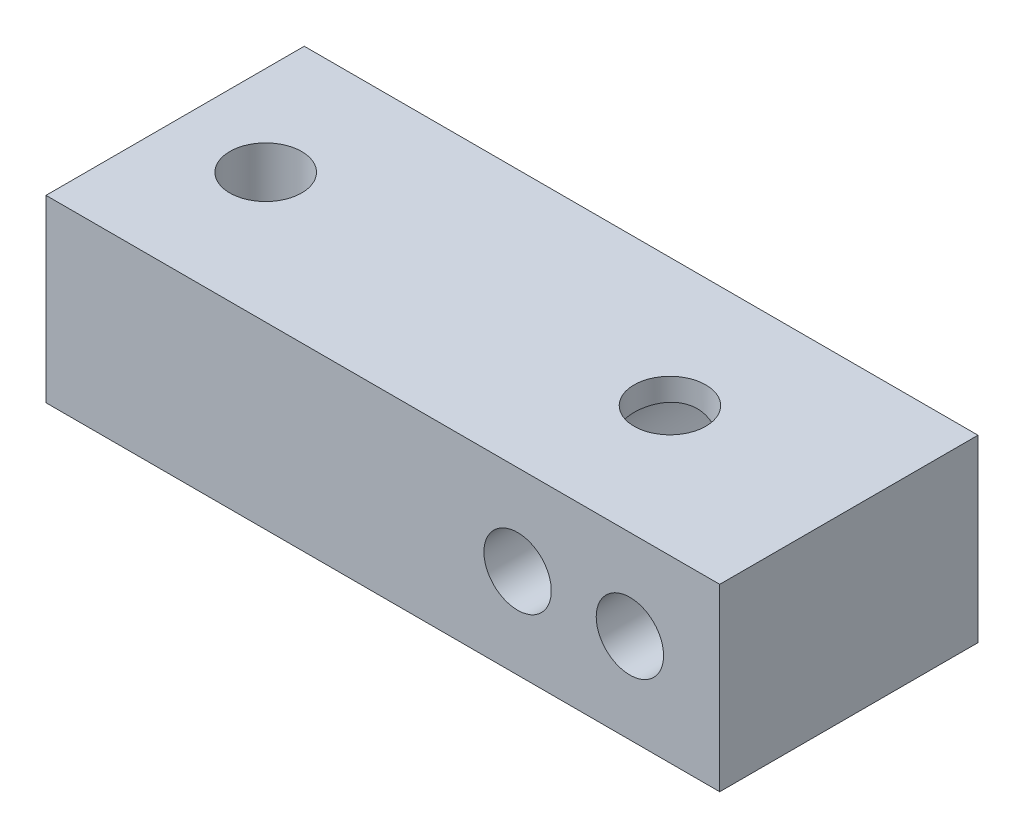
ISO-10303-21;
HEADER;
FILE_DESCRIPTION(('STEP AP214'),'2;1');
FILE_NAME('part.step','',(''),(''),'','','');
FILE_SCHEMA(('AUTOMOTIVE_DESIGN { 1 0 10303 214 1 1 1 1 }'));
ENDSEC;
DATA;
#1=APPLICATION_CONTEXT('core data for automotive mechanical design processes');
#2=APPLICATION_PROTOCOL_DEFINITION('international standard','automotive_design',2000,#1);
#3=PRODUCT_CONTEXT('',#1,'mechanical');
#4=PRODUCT('Part','Part','',(#3));
#5=PRODUCT_RELATED_PRODUCT_CATEGORY('part','',(#4));
#6=PRODUCT_DEFINITION_FORMATION('','',#4);
#7=PRODUCT_DEFINITION_CONTEXT('part definition',#1,'design');
#8=PRODUCT_DEFINITION('design','',#6,#7);
#9=PRODUCT_DEFINITION_SHAPE('','',#8);
#10=(LENGTH_UNIT() NAMED_UNIT(*) SI_UNIT(.MILLI.,.METRE.));
#11=(NAMED_UNIT(*) PLANE_ANGLE_UNIT() SI_UNIT($,.RADIAN.));
#12=(NAMED_UNIT(*) SI_UNIT($,.STERADIAN.) SOLID_ANGLE_UNIT());
#13=UNCERTAINTY_MEASURE_WITH_UNIT(LENGTH_MEASURE(1.E-05),#10,'distance_accuracy_value','');
#14=(GEOMETRIC_REPRESENTATION_CONTEXT(3) GLOBAL_UNCERTAINTY_ASSIGNED_CONTEXT((#13)) GLOBAL_UNIT_ASSIGNED_CONTEXT((#10,
#11,#12)) REPRESENTATION_CONTEXT('',''));
#15=CARTESIAN_POINT('',(0.,0.,0.));
#16=DIRECTION('',(0.,0.,1.));
#17=DIRECTION('',(1.,0.,0.));
#18=AXIS2_PLACEMENT_3D('',#15,#16,#17);
#19=CARTESIAN_POINT('',(26.0000000000038,4.0000000000032,0.));
#20=DIRECTION('',(0.,0.,-1.));
#21=DIRECTION('',(-1.,0.,0.));
#22=AXIS2_PLACEMENT_3D('',#19,#20,#21);
#23=CYLINDRICAL_SURFACE('',#22,1.49999999999973);
#24=CARTESIAN_POINT('',(26.0000000000038,4.0000000000032,0.));
#25=DIRECTION('',(0.,0.,-1.));
#26=DIRECTION('',(-1.,0.,0.));
#27=AXIS2_PLACEMENT_3D('',#24,#25,#26);
#28=CIRCLE('',#27,1.49999999999973);
#29=CARTESIAN_POINT('',(24.5000000000041,4.0000000000032,0.));
#30=VERTEX_POINT('',#29);
#31=EDGE_CURVE('E139',#30,#30,#28,.T.);
#32=ORIENTED_EDGE('',*,*,#31,.F.);
#33=EDGE_LOOP('',(#32));
#34=FACE_BOUND('',#33,.T.);
#35=CARTESIAN_POINT('',(26.0000000000038,4.0000000000032,-2.5));
#36=DIRECTION('',(0.,0.,-1.));
#37=DIRECTION('',(-1.,0.,0.));
#38=AXIS2_PLACEMENT_3D('',#35,#36,#37);
#39=CIRCLE('',#38,1.49999999999973);
#40=CARTESIAN_POINT('',(24.5000000000041,4.0000000000032,-2.5));
#41=VERTEX_POINT('',#40);
#42=EDGE_CURVE('E124',#41,#41,#39,.F.);
#43=ORIENTED_EDGE('',*,*,#42,.F.);
#44=EDGE_LOOP('',(#43));
#45=FACE_BOUND('',#44,.T.);
#46=ADVANCED_FACE('F33',(#34,#45),#23,.F.);
#47=CARTESIAN_POINT('',(21.0000000000038,4.00000000000325,0.));
#48=DIRECTION('',(0.,0.,-1.));
#49=DIRECTION('',(-1.,0.,0.));
#50=AXIS2_PLACEMENT_3D('',#47,#48,#49);
#51=CYLINDRICAL_SURFACE('',#50,1.49999999999973);
#52=CARTESIAN_POINT('',(21.0000000000038,4.00000000000325,0.));
#53=DIRECTION('',(0.,0.,-1.));
#54=DIRECTION('',(-1.,0.,0.));
#55=AXIS2_PLACEMENT_3D('',#52,#53,#54);
#56=CIRCLE('',#55,1.49999999999973);
#57=CARTESIAN_POINT('',(19.5000000000041,4.00000000000325,0.));
#58=VERTEX_POINT('',#57);
#59=EDGE_CURVE('E140',#58,#58,#56,.T.);
#60=ORIENTED_EDGE('',*,*,#59,.F.);
#61=EDGE_LOOP('',(#60));
#62=FACE_BOUND('',#61,.T.);
#63=CARTESIAN_POINT('',(21.0000000000038,4.00000000000325,-2.5));
#64=DIRECTION('',(0.,0.,-1.));
#65=DIRECTION('',(-1.,0.,0.));
#66=AXIS2_PLACEMENT_3D('',#63,#64,#65);
#67=CIRCLE('',#66,1.49999999999973);
#68=CARTESIAN_POINT('',(19.5000000000041,4.00000000000325,-2.5));
#69=VERTEX_POINT('',#68);
#70=EDGE_CURVE('E37',#69,#69,#67,.F.);
#71=ORIENTED_EDGE('',*,*,#70,.F.);
#72=EDGE_LOOP('',(#71));
#73=FACE_BOUND('',#72,.T.);
#74=ADVANCED_FACE('F241',(#62,#73),#51,.F.);
#75=CARTESIAN_POINT('',(21.9985961746949,10.,-5.78439094094337));
#76=DIRECTION('',(0.,-1.,0.));
#77=DIRECTION('',(0.,0.,-1.));
#78=AXIS2_PLACEMENT_3D('',#75,#76,#77);
#79=CYLINDRICAL_SURFACE('',#78,1.59816028146403);
#80=CARTESIAN_POINT('',(23.5000000000038,2.34168760482552,-5.23675708644099));
#81=CARTESIAN_POINT('',(23.5084441149102,2.32895804003528,-5.25990497557719));
#82=CARTESIAN_POINT('',(23.5164906276901,2.317037901698,-5.28363333761184));
#83=CARTESIAN_POINT('',(23.5316494583918,2.29488249522649,-5.33216215938728));
#84=CARTESIAN_POINT('',(23.5387614188901,2.28464787134743,-5.35696302451952));
#85=CARTESIAN_POINT('',(23.5584813569481,2.25657961791651,-5.43282848443087));
#86=CARTESIAN_POINT('',(23.5694683154035,2.24138909110811,-5.48534236967706));
#87=CARTESIAN_POINT('',(23.5861815255182,2.21851605776157,-5.59291790591631));
#88=CARTESIAN_POINT('',(23.5918945625479,2.21085240793148,-5.64798559561594));
#89=CARTESIAN_POINT('',(23.5975153274381,2.20331117772063,-5.75889407443124));
#90=CARTESIAN_POINT('',(23.597429810478,2.20342453730817,-5.81473388818606));
#91=CARTESIAN_POINT('',(23.5915631455986,2.2112984356357,-5.92397797544944));
#92=CARTESIAN_POINT('',(23.5859410515289,2.21884542352992,-5.97740672480101));
#93=CARTESIAN_POINT('',(23.5696939157016,2.24108008179192,-6.08199249234808));
#94=CARTESIAN_POINT('',(23.559067664078,2.25576947902342,-6.13314895789368));
#95=CARTESIAN_POINT('',(23.5396824842276,2.28332564692982,-6.2085333780644));
#96=CARTESIAN_POINT('',(23.5324116097938,2.29377707850055,-6.23406932537069));
#97=CARTESIAN_POINT('',(23.5168979218934,2.31643474392924,-6.28394690725396));
#98=CARTESIAN_POINT('',(23.5086580365554,2.32863571440245,-6.30829184039318));
#99=CARTESIAN_POINT('',(23.5000000000038,2.34168760482552,-6.33202479544576));
#100=B_SPLINE_CURVE_WITH_KNOTS('',3,(#80,#81,#82,#83,#84,#85,#86,#87,#88,#89,#90,#91,#92,#93,
#94,#95,#96,#97,#98,#99),.UNSPECIFIED.,.F.,.F.,(4,2,2,2,2,2,2,2,2,4),(0.,0.0831620691936261,
0.166355852064897,0.332791775815998,0.499643607590679,0.666301064239259,0.828306462975498,
0.990351050232776,1.07586948675496,1.16113584330163),.UNSPECIFIED.);
#101=CARTESIAN_POINT('',(23.5000000000038,2.34168760482552,-5.23675708644099));
#102=VERTEX_POINT('',#101);
#103=CARTESIAN_POINT('',(23.5000000000038,2.34168760482552,-6.33202479544576));
#104=VERTEX_POINT('',#103);
#105=EDGE_CURVE('E42',#102,#104,#100,.T.);
#106=ORIENTED_EDGE('',*,*,#105,.T.);
#107=CARTESIAN_POINT('',(23.5000000000038,2.34168760482552,-6.33202479544576));
#108=CARTESIAN_POINT('',(23.4895414621896,2.3259171039936,-6.36068639631717));
#109=CARTESIAN_POINT('',(23.4784016313287,2.30945080935531,-6.38869064831332));
#110=CARTESIAN_POINT('',(23.4548450309957,2.27542439317822,-6.44344004203682));
#111=CARTESIAN_POINT('',(23.4424292465318,2.25786511946387,-6.47018613212761));
#112=CARTESIAN_POINT('',(23.4034276450788,2.20403442481352,-6.54856992756507));
#113=CARTESIAN_POINT('',(23.3750410736527,2.16653853476035,-6.59847804187788));
#114=CARTESIAN_POINT('',(23.3137958068056,2.08982570255991,-6.69411208339586));
#115=CARTESIAN_POINT('',(23.2809319551235,2.05060681192704,-6.73983308548004));
#116=CARTESIAN_POINT('',(23.210895007702,1.97151805917279,-6.82726390781098));
#117=CARTESIAN_POINT('',(23.173719713753,1.93164787396475,-6.86897166188048));
#118=CARTESIAN_POINT('',(23.0676849149294,1.82429788279609,-6.97610253267155));
#119=CARTESIAN_POINT('',(22.9948107377929,1.75695614453381,-7.03777765138717));
#120=CARTESIAN_POINT('',(22.8370562907593,1.62603236730116,-7.14833760891538));
#121=CARTESIAN_POINT('',(22.7521896379139,1.56244617857214,-7.19723677741163));
#122=CARTESIAN_POINT('',(22.5852860060906,1.45141804018137,-7.27332981186249));
#123=CARTESIAN_POINT('',(22.5049084304588,1.40301068396129,-7.30272921936104));
#124=CARTESIAN_POINT('',(22.3370666309609,1.31275069734338,-7.34871503996302));
#125=CARTESIAN_POINT('',(22.2496070847312,1.27089379310655,-7.36530983544732));
#126=CARTESIAN_POINT('',(22.0688210745086,1.19513012069802,-7.38360932616291));
#127=CARTESIAN_POINT('',(21.9754507361321,1.161294595798,-7.38518513065492));
#128=CARTESIAN_POINT('',(21.7869520529434,1.10338183397819,-7.37128228286152));
#129=CARTESIAN_POINT('',(21.6918252829428,1.07929626095664,-7.3558182417473));
#130=CARTESIAN_POINT('',(21.5172329698989,1.04377035978801,-7.31062193790429));
#131=CARTESIAN_POINT('',(21.4374304521764,1.03103660384319,-7.28317516258997));
#132=CARTESIAN_POINT('',(21.2825290799872,1.01231515402243,-7.21564792606563));
#133=CARTESIAN_POINT('',(21.2074295638408,1.00632650913314,-7.17556924688555));
#134=CARTESIAN_POINT('',(21.0673663193762,0.999968906046933,-7.08576291670897));
#135=CARTESIAN_POINT('',(21.002112997376,0.99937926078122,-7.03649912083638));
#136=CARTESIAN_POINT('',(20.8799166180659,1.00178060199751,-6.92864495221745));
#137=CARTESIAN_POINT('',(20.8229753840654,1.0047723727657,-6.87005253905481));
#138=CARTESIAN_POINT('',(20.7157037169982,1.01298783007599,-6.74132575072862));
#139=CARTESIAN_POINT('',(20.6659498648274,1.01833113203448,-6.67071847184178));
#140=CARTESIAN_POINT('',(20.578449336488,1.02943672892339,-6.52243868277171));
#141=CARTESIAN_POINT('',(20.5407056270447,1.03519912694701,-6.44476443300085));
#142=CARTESIAN_POINT('',(20.4768052343081,1.04578762776922,-6.28072717698085));
#143=CARTESIAN_POINT('',(20.4512326660524,1.05056126001977,-6.19413209240748));
#144=CARTESIAN_POINT('',(20.4150097048244,1.05752957261268,-6.01778070429519));
#145=CARTESIAN_POINT('',(20.4043569649364,1.05972465855622,-5.92802490022071));
#146=CARTESIAN_POINT('',(20.3983527908292,1.06094748209506,-5.74914264076932));
#147=CARTESIAN_POINT('',(20.4028056696287,1.06001572828308,-5.66002301123653));
#148=CARTESIAN_POINT('',(20.4264369426997,1.05531545022257,-5.48383581334298));
#149=CARTESIAN_POINT('',(20.4456162956752,1.05154674128657,-5.39676837896195));
#150=CARTESIAN_POINT('',(20.4979752773274,1.0421852893145,-5.22756253711448));
#151=CARTESIAN_POINT('',(20.5310819566359,1.0366020845241,-5.14540095810611));
#152=CARTESIAN_POINT('',(20.6103838353433,1.02513899455867,-4.98766125366166));
#153=CARTESIAN_POINT('',(20.6565819702557,1.01925904308707,-4.91208460974899));
#154=CARTESIAN_POINT('',(20.7619014311051,1.00898751104369,-4.76811892514225));
#155=CARTESIAN_POINT('',(20.82125659242,1.00462709692404,-4.69989823428098));
#156=CARTESIAN_POINT('',(20.950703598357,0.999707981102864,-4.57436692611058));
#157=CARTESIAN_POINT('',(21.0207923189351,0.999148175361816,-4.51705314515354));
#158=CARTESIAN_POINT('',(21.1673159550558,1.0038008293469,-4.41664103118778));
#159=CARTESIAN_POINT('',(21.243501154675,1.0088426692401,-4.37317166327038));
#160=CARTESIAN_POINT('',(21.4012897766905,1.02590421874281,-4.29949634729937));
#161=CARTESIAN_POINT('',(21.4828901682617,1.03792005377134,-4.26928305085025));
#162=CARTESIAN_POINT('',(21.6432101123418,1.06870009713741,-4.22416267121029));
#163=CARTESIAN_POINT('',(21.7217843741345,1.08698822866607,-4.20840671318661));
#164=CARTESIAN_POINT('',(21.8785200464517,1.13036309083413,-4.18879116129489));
#165=CARTESIAN_POINT('',(21.9566814183898,1.1554504458191,-4.18493266032578));
#166=CARTESIAN_POINT('',(22.1114591608309,1.21225021427115,-4.18831598167587));
#167=CARTESIAN_POINT('',(22.1880406313716,1.24404716395112,-4.1957077402387));
#168=CARTESIAN_POINT('',(22.3369275311911,1.31311021562382,-4.22062781520454));
#169=CARTESIAN_POINT('',(22.4092312900494,1.35037843459407,-4.23816006298288));
#170=CARTESIAN_POINT('',(22.5754223013573,1.44454866095558,-4.29052662839607));
#171=CARTESIAN_POINT('',(22.6668840554848,1.50348082657275,-4.32942551698687));
#172=CARTESIAN_POINT('',(22.8384578087601,1.62696286246995,-4.42120974358241));
#173=CARTESIAN_POINT('',(22.9185389754949,1.69152725658651,-4.47413200439318));
#174=CARTESIAN_POINT('',(23.0679214606838,1.82426319000382,-4.59279459584641));
#175=CARTESIAN_POINT('',(23.1370415606746,1.89247449889028,-4.65871656846298));
#176=CARTESIAN_POINT('',(23.2627039981312,2.02803541442189,-4.80193742851409));
#177=CARTESIAN_POINT('',(23.3192857791385,2.09538707661006,-4.87919932957584));
#178=CARTESIAN_POINT('',(23.3946305089905,2.19238961756677,-5.00488823143839));
#179=CARTESIAN_POINT('',(23.4182728880627,2.22423629970729,-5.04871791243056));
#180=CARTESIAN_POINT('',(23.4619369251678,2.28526914439328,-5.13996419600722));
#181=CARTESIAN_POINT('',(23.4819540517634,2.31445195491329,-5.18738518407782));
#182=CARTESIAN_POINT('',(23.5000000000038,2.34168760482552,-5.23675708644099));
#183=B_SPLINE_CURVE_WITH_KNOTS('',3,(#107,#108,#109,#110,#111,#112,#113,#114,#115,#116,#117,
#118,#119,#120,#121,#122,#123,#124,#125,#126,#127,#128,#129,#130,#131,#132,#133,#134,#135,#136,
#137,#138,#139,#140,#141,#142,#143,#144,#145,#146,#147,#148,#149,#150,#151,#152,#153,#154,#155,
#156,#157,#158,#159,#160,#161,#162,#163,#164,#165,#166,#167,#168,#169,#170,#171,#172,#173,#174,
#175,#176,#177,#178,#179,#180,#181,#182),.UNSPECIFIED.,.F.,.F.,(4,2,2,2,2,2,2,2,2,2,2,2,2,2,2,2,
2,2,2,2,2,2,2,2,2,2,2,2,2,2,2,2,2,2,2,2,2,4),(0.,0.102980999275482,0.205883088294859,
0.411236096525745,0.616827630899233,0.822524451782126,1.17168513916481,1.52045250533456,
1.81429114785793,2.10793726896466,2.40410117148808,2.70001131957421,2.9547353984221,
3.20942355846385,3.45365227911348,3.6979344926429,3.95641470956991,4.21495872637174,
4.48489973000373,4.75479826666336,5.02121380350829,5.2876466856631,5.5527010721353,
5.81781493917989,6.08808422686548,6.35827500060911,6.62045629865378,6.88249207442963,
7.1279169497003,7.37336436899818,7.62211171719816,7.87095556718295,8.21573495196537,
8.56143130187526,8.91235247120388,9.26215351233491,9.43924806245851,9.61656246928556),.UNSPECIFIED.);
#184=EDGE_CURVE('E11',#104,#102,#183,.T.);
#185=ORIENTED_EDGE('',*,*,#184,.T.);
#186=EDGE_LOOP('',(#106,#185));
#187=FACE_BOUND('',#186,.T.);
#188=CARTESIAN_POINT('',(21.9985961746949,0.,-5.78439094094337));
#189=DIRECTION('',(0.,-1.,0.));
#190=DIRECTION('',(0.,0.,-1.));
#191=AXIS2_PLACEMENT_3D('',#188,#189,#190);
#192=CIRCLE('',#191,1.59816028146403);
#193=CARTESIAN_POINT('',(21.9985961746949,0.,-7.38255122240741));
#194=VERTEX_POINT('',#193);
#195=EDGE_CURVE('E128',#194,#194,#192,.T.);
#196=ORIENTED_EDGE('',*,*,#195,.T.);
#197=EDGE_LOOP('',(#196));
#198=FACE_BOUND('',#197,.T.);
#199=ADVANCED_FACE('F247',(#187,#198),#79,.F.);
#200=CARTESIAN_POINT('',(0.,8.,0.));
#201=DIRECTION('',(1.,0.,0.));
#202=DIRECTION('',(0.,0.,-1.));
#203=AXIS2_PLACEMENT_3D('',#200,#201,#202);
#204=PLANE('',#203);
#205=DIRECTION('',(0.,0.,1.));
#206=VECTOR('',#205,1.);
#207=CARTESIAN_POINT('',(0.,0.,0.));
#208=LINE('',#207,#206);
#209=CARTESIAN_POINT('',(0.,0.,-11.5));
#210=VERTEX_POINT('',#209);
#211=CARTESIAN_POINT('',(0.,0.,0.));
#212=VERTEX_POINT('',#211);
#213=EDGE_CURVE('E143',#210,#212,#208,.T.);
#214=ORIENTED_EDGE('',*,*,#213,.T.);
#215=DIRECTION('',(0.,-1.,0.));
#216=VECTOR('',#215,1.);
#217=CARTESIAN_POINT('',(0.,8.,0.));
#218=LINE('',#217,#216);
#219=CARTESIAN_POINT('',(0.,8.,0.));
#220=VERTEX_POINT('',#219);
#221=EDGE_CURVE('E172',#220,#212,#218,.T.);
#222=ORIENTED_EDGE('',*,*,#221,.F.);
#223=DIRECTION('',(0.,0.,1.));
#224=VECTOR('',#223,1.);
#225=CARTESIAN_POINT('',(0.,8.,0.));
#226=LINE('',#225,#224);
#227=CARTESIAN_POINT('',(0.,8.,-11.5));
#228=VERTEX_POINT('',#227);
#229=EDGE_CURVE('E146',#228,#220,#226,.T.);
#230=ORIENTED_EDGE('',*,*,#229,.F.);
#231=DIRECTION('',(0.,-1.,0.));
#232=VECTOR('',#231,1.);
#233=CARTESIAN_POINT('',(0.,8.,-11.5));
#234=LINE('',#233,#232);
#235=EDGE_CURVE('E156',#228,#210,#234,.T.);
#236=ORIENTED_EDGE('',*,*,#235,.T.);
#237=EDGE_LOOP('',(#214,#222,#230,#236));
#238=FACE_BOUND('',#237,.T.);
#239=ADVANCED_FACE('F35',(#238),#204,.F.);
#240=CARTESIAN_POINT('',(0.,8.,0.));
#241=DIRECTION('',(0.,0.,-1.));
#242=DIRECTION('',(-1.,0.,0.));
#243=AXIS2_PLACEMENT_3D('',#240,#241,#242);
#244=PLANE('',#243);
#245=ORIENTED_EDGE('',*,*,#59,.T.);
#246=EDGE_LOOP('',(#245));
#247=FACE_BOUND('',#246,.T.);
#248=ORIENTED_EDGE('',*,*,#31,.T.);
#249=EDGE_LOOP('',(#248));
#250=FACE_BOUND('',#249,.T.);
#251=DIRECTION('',(1.,0.,0.));
#252=VECTOR('',#251,1.);
#253=CARTESIAN_POINT('',(0.,0.,0.));
#254=LINE('',#253,#252);
#255=CARTESIAN_POINT('',(30.,0.,0.));
#256=VERTEX_POINT('',#255);
#257=EDGE_CURVE('E159',#212,#256,#254,.T.);
#258=ORIENTED_EDGE('',*,*,#257,.T.);
#259=DIRECTION('',(0.,-1.,0.));
#260=VECTOR('',#259,1.);
#261=CARTESIAN_POINT('',(30.,8.,0.));
#262=LINE('',#261,#260);
#263=CARTESIAN_POINT('',(30.,8.,0.));
#264=VERTEX_POINT('',#263);
#265=EDGE_CURVE('E169',#264,#256,#262,.T.);
#266=ORIENTED_EDGE('',*,*,#265,.F.);
#267=DIRECTION('',(1.,0.,0.));
#268=VECTOR('',#267,1.);
#269=CARTESIAN_POINT('',(0.,8.,0.));
#270=LINE('',#269,#268);
#271=EDGE_CURVE('E149',#220,#264,#270,.T.);
#272=ORIENTED_EDGE('',*,*,#271,.F.);
#273=ORIENTED_EDGE('',*,*,#221,.T.);
#274=EDGE_LOOP('',(#258,#266,#272,#273));
#275=FACE_BOUND('',#274,.T.);
#276=ADVANCED_FACE('F230',(#247,#250,#275),#244,.F.);
#277=CARTESIAN_POINT('',(30.,8.,0.));
#278=DIRECTION('',(-1.,0.,0.));
#279=DIRECTION('',(0.,0.,1.));
#280=AXIS2_PLACEMENT_3D('',#277,#278,#279);
#281=PLANE('',#280);
#282=DIRECTION('',(0.,0.,-1.));
#283=VECTOR('',#282,1.);
#284=CARTESIAN_POINT('',(30.,0.,0.));
#285=LINE('',#284,#283);
#286=CARTESIAN_POINT('',(30.,0.,-11.5));
#287=VERTEX_POINT('',#286);
#288=EDGE_CURVE('E161',#256,#287,#285,.T.);
#289=ORIENTED_EDGE('',*,*,#288,.T.);
#290=DIRECTION('',(0.,-1.,0.));
#291=VECTOR('',#290,1.);
#292=CARTESIAN_POINT('',(30.,8.,-11.5));
#293=LINE('',#292,#291);
#294=CARTESIAN_POINT('',(30.,8.,-11.5));
#295=VERTEX_POINT('',#294);
#296=EDGE_CURVE('E166',#295,#287,#293,.T.);
#297=ORIENTED_EDGE('',*,*,#296,.F.);
#298=DIRECTION('',(0.,0.,-1.));
#299=VECTOR('',#298,1.);
#300=CARTESIAN_POINT('',(30.,8.,0.));
#301=LINE('',#300,#299);
#302=EDGE_CURVE('E152',#264,#295,#301,.T.);
#303=ORIENTED_EDGE('',*,*,#302,.F.);
#304=ORIENTED_EDGE('',*,*,#265,.T.);
#305=EDGE_LOOP('',(#289,#297,#303,#304));
#306=FACE_BOUND('',#305,.T.);
#307=ADVANCED_FACE('F215',(#306),#281,.F.);
#308=CARTESIAN_POINT('',(0.,8.,-11.5));
#309=DIRECTION('',(0.,0.,1.));
#310=DIRECTION('',(1.,0.,0.));
#311=AXIS2_PLACEMENT_3D('',#308,#309,#310);
#312=PLANE('',#311);
#313=CARTESIAN_POINT('',(26.0000000000038,4.0000000000032,-11.5));
#314=DIRECTION('',(0.,0.,-1.));
#315=DIRECTION('',(-1.,0.,0.));
#316=AXIS2_PLACEMENT_3D('',#313,#314,#315);
#317=CIRCLE('',#316,3.);
#318=CARTESIAN_POINT('',(23.5000000000038,5.65831239518093,-11.5));
#319=VERTEX_POINT('',#318);
#320=CARTESIAN_POINT('',(23.5000000000038,2.34168760482552,-11.5));
#321=VERTEX_POINT('',#320);
#322=EDGE_CURVE('E115',#319,#321,#317,.T.);
#323=ORIENTED_EDGE('',*,*,#322,.F.);
#324=CARTESIAN_POINT('',(21.0000000000038,4.00000000000325,-11.5));
#325=DIRECTION('',(0.,0.,-1.));
#326=DIRECTION('',(-1.,0.,0.));
#327=AXIS2_PLACEMENT_3D('',#324,#325,#326);
#328=CIRCLE('',#327,3.);
#329=EDGE_CURVE('E49',#321,#319,#328,.T.);
#330=ORIENTED_EDGE('',*,*,#329,.F.);
#331=EDGE_LOOP('',(#323,#330));
#332=FACE_BOUND('',#331,.T.);
#333=DIRECTION('',(-1.,0.,0.));
#334=VECTOR('',#333,1.);
#335=CARTESIAN_POINT('',(0.,0.,-11.5));
#336=LINE('',#335,#334);
#337=EDGE_CURVE('E150',#287,#210,#336,.T.);
#338=ORIENTED_EDGE('',*,*,#337,.T.);
#339=ORIENTED_EDGE('',*,*,#235,.F.);
#340=DIRECTION('',(-1.,0.,0.));
#341=VECTOR('',#340,1.);
#342=CARTESIAN_POINT('',(0.,8.,-11.5));
#343=LINE('',#342,#341);
#344=EDGE_CURVE('E154',#295,#228,#343,.T.);
#345=ORIENTED_EDGE('',*,*,#344,.F.);
#346=ORIENTED_EDGE('',*,*,#296,.T.);
#347=EDGE_LOOP('',(#338,#339,#345,#346));
#348=FACE_BOUND('',#347,.T.);
#349=ADVANCED_FACE('F211',(#332,#348),#312,.F.);
#350=CARTESIAN_POINT('',(0.,8.,0.));
#351=DIRECTION('',(0.,-1.,0.));
#352=DIRECTION('',(0.,0.,-1.));
#353=AXIS2_PLACEMENT_3D('',#350,#351,#352);
#354=PLANE('',#353);
#355=CARTESIAN_POINT('',(21.9985961746949,8.,-5.78439094094337));
#356=DIRECTION('',(0.,-1.,0.));
#357=DIRECTION('',(0.,0.,-1.));
#358=AXIS2_PLACEMENT_3D('',#355,#356,#357);
#359=CIRCLE('',#358,1.59816028146403);
#360=CARTESIAN_POINT('',(21.9985961746949,8.,-7.38255122240741));
#361=VERTEX_POINT('',#360);
#362=EDGE_CURVE('E131',#361,#361,#359,.T.);
#363=ORIENTED_EDGE('',*,*,#362,.T.);
#364=EDGE_LOOP('',(#363));
#365=FACE_BOUND('',#364,.T.);
#366=CARTESIAN_POINT('',(4.00047760406449,8.,-5.78270568313571));
#367=DIRECTION('',(0.,-1.,0.));
#368=DIRECTION('',(0.,0.,-1.));
#369=AXIS2_PLACEMENT_3D('',#366,#367,#368);
#370=CIRCLE('',#369,1.60099342901495);
#371=CARTESIAN_POINT('',(4.00047760406449,8.,-7.38369911215066));
#372=VERTEX_POINT('',#371);
#373=EDGE_CURVE('E136',#372,#372,#370,.T.);
#374=ORIENTED_EDGE('',*,*,#373,.T.);
#375=EDGE_LOOP('',(#374));
#376=FACE_BOUND('',#375,.T.);
#377=ORIENTED_EDGE('',*,*,#229,.T.);
#378=ORIENTED_EDGE('',*,*,#271,.T.);
#379=ORIENTED_EDGE('',*,*,#302,.T.);
#380=ORIENTED_EDGE('',*,*,#344,.T.);
#381=EDGE_LOOP('',(#377,#378,#379,#380));
#382=FACE_BOUND('',#381,.T.);
#383=ADVANCED_FACE('F214',(#365,#376,#382),#354,.F.);
#384=CARTESIAN_POINT('',(0.,0.,0.));
#385=DIRECTION('',(0.,-1.,0.));
#386=DIRECTION('',(0.,0.,-1.));
#387=AXIS2_PLACEMENT_3D('',#384,#385,#386);
#388=PLANE('',#387);
#389=ORIENTED_EDGE('',*,*,#195,.F.);
#390=EDGE_LOOP('',(#389));
#391=FACE_BOUND('',#390,.T.);
#392=CARTESIAN_POINT('',(4.00047760406449,0.,-5.78270568313571));
#393=DIRECTION('',(0.,-1.,0.));
#394=DIRECTION('',(0.,0.,-1.));
#395=AXIS2_PLACEMENT_3D('',#392,#393,#394);
#396=CIRCLE('',#395,1.60099342901495);
#397=CARTESIAN_POINT('',(4.00047760406449,0.,-7.38369911215066));
#398=VERTEX_POINT('',#397);
#399=EDGE_CURVE('E127',#398,#398,#396,.T.);
#400=ORIENTED_EDGE('',*,*,#399,.F.);
#401=EDGE_LOOP('',(#400));
#402=FACE_BOUND('',#401,.T.);
#403=ORIENTED_EDGE('',*,*,#213,.F.);
#404=ORIENTED_EDGE('',*,*,#337,.F.);
#405=ORIENTED_EDGE('',*,*,#288,.F.);
#406=ORIENTED_EDGE('',*,*,#257,.F.);
#407=EDGE_LOOP('',(#403,#404,#405,#406));
#408=FACE_BOUND('',#407,.T.);
#409=ADVANCED_FACE('F227',(#391,#402,#408),#388,.T.);
#410=CARTESIAN_POINT('',(23.5000000000038,5.65831239518093,-6.33202479544567));
#411=CARTESIAN_POINT('',(23.5084441149102,5.67104195997116,-6.30887690630946));
#412=CARTESIAN_POINT('',(23.5164906276902,5.68296209830845,-6.28514854427482));
#413=CARTESIAN_POINT('',(23.5316494583918,5.70511750477995,-6.23661972249937));
#414=CARTESIAN_POINT('',(23.5387614188901,5.71535212865901,-6.21181885736712));
#415=CARTESIAN_POINT('',(23.5584813569481,5.74342038208992,-6.13595339745577));
#416=CARTESIAN_POINT('',(23.5694683154035,5.75861090889831,-6.08343951220959));
#417=CARTESIAN_POINT('',(23.5861815255182,5.78148394224485,-5.97586397597034));
#418=CARTESIAN_POINT('',(23.5918945625479,5.78914759207493,-5.9207962862707));
#419=CARTESIAN_POINT('',(23.5975153274381,5.79668882228577,-5.8098878074554));
#420=CARTESIAN_POINT('',(23.597429810478,5.79657546269822,-5.75404799370059));
#421=CARTESIAN_POINT('',(23.5915631455986,5.78870156437068,-5.64480390643721));
#422=CARTESIAN_POINT('',(23.5859410515289,5.78115457647646,-5.59137515708564));
#423=CARTESIAN_POINT('',(23.5696939157016,5.75891991821445,-5.48678938953857));
#424=CARTESIAN_POINT('',(23.559067664078,5.74423052098295,-5.43563292399297));
#425=CARTESIAN_POINT('',(23.5396824842276,5.71667435307656,-5.36024850382228));
#426=CARTESIAN_POINT('',(23.5324116097938,5.70622292150584,-5.33471255651604));
#427=CARTESIAN_POINT('',(23.5168979218934,5.68356525607718,-5.28483497463283));
#428=CARTESIAN_POINT('',(23.5086580365554,5.67136428560398,-5.26049004149363));
#429=CARTESIAN_POINT('',(23.5000000000038,5.65831239518093,-5.23675708644108));
#430=B_SPLINE_CURVE_WITH_KNOTS('',3,(#410,#411,#412,#413,#414,#415,#416,#417,#418,#419,#420,
#421,#422,#423,#424,#425,#426,#427,#428,#429),.UNSPECIFIED.,.F.,.F.,(4,2,2,2,2,2,2,2,2,4),(0.,
0.0831620691936253,0.166355852064896,0.332791775815993,0.499643607590673,0.666301064239249,
0.828306462975487,0.990351050232764,1.07586948675484,1.1611358433014),.UNSPECIFIED.);
#431=CARTESIAN_POINT('',(23.5000000000038,5.65831239518093,-6.33202479544567));
#432=VERTEX_POINT('',#431);
#433=CARTESIAN_POINT('',(23.5000000000038,5.65831239518093,-5.23675708644108));
#434=VERTEX_POINT('',#433);
#435=EDGE_CURVE('E175',#432,#434,#430,.T.);
#436=ORIENTED_EDGE('',*,*,#435,.T.);
#437=CARTESIAN_POINT('',(23.5000000000038,5.65831239518093,-5.23675708644108));
#438=CARTESIAN_POINT('',(23.4895414621896,5.67408289601284,-5.20809548556968));
#439=CARTESIAN_POINT('',(23.4784016313288,5.69054919065113,-5.18009123357352));
#440=CARTESIAN_POINT('',(23.4548450309958,5.72457560682822,-5.12534183985001));
#441=CARTESIAN_POINT('',(23.4424292465318,5.74213488054257,-5.09859574975923));
#442=CARTESIAN_POINT('',(23.4034276450788,5.79596557519293,-5.02021195432177));
#443=CARTESIAN_POINT('',(23.3750410736527,5.83346146524609,-4.97030384000895));
#444=CARTESIAN_POINT('',(23.3137958068057,5.91017429744653,-4.87466979849097));
#445=CARTESIAN_POINT('',(23.2809319551235,5.9493931880794,-4.82894879640678));
#446=CARTESIAN_POINT('',(23.210895007702,6.02848194083365,-4.74151797407583));
#447=CARTESIAN_POINT('',(23.1737197137531,6.06835212604169,-4.69981022000634));
#448=CARTESIAN_POINT('',(23.0676849149295,6.17570211721034,-4.59267934921527));
#449=CARTESIAN_POINT('',(22.994810737793,6.24304385547262,-4.53100423049964));
#450=CARTESIAN_POINT('',(22.8370562907594,6.37396763270526,-4.42044427297143));
#451=CARTESIAN_POINT('',(22.752189637914,6.43755382143428,-4.37154510447519));
#452=CARTESIAN_POINT('',(22.5852860060907,6.54858195982506,-4.29545207002432));
#453=CARTESIAN_POINT('',(22.5049084304589,6.59698931604513,-4.26605266252575));
#454=CARTESIAN_POINT('',(22.3370666309611,6.68724930266306,-4.22006684192376));
#455=CARTESIAN_POINT('',(22.2496070847313,6.7291062068999,-4.20347204643944));
#456=CARTESIAN_POINT('',(22.0688210745087,6.80486987930844,-4.18517255572384));
#457=CARTESIAN_POINT('',(21.9754507361322,6.83870540420847,-4.18359675123183));
#458=CARTESIAN_POINT('',(21.7869520529435,6.89661816602829,-4.19749959902521));
#459=CARTESIAN_POINT('',(21.6918252829429,6.92070373904984,-4.21296364013944));
#460=CARTESIAN_POINT('',(21.517232969899,6.95622964021848,-4.25815994398243));
#461=CARTESIAN_POINT('',(21.4374304521765,6.9689633961633,-4.28560671929675));
#462=CARTESIAN_POINT('',(21.2825290799873,6.98768484598407,-4.35313395582108));
#463=CARTESIAN_POINT('',(21.2074295638409,6.99367349087336,-4.39321263500116));
#464=CARTESIAN_POINT('',(21.0673663193762,7.00003109395957,-4.48301896517773));
#465=CARTESIAN_POINT('',(21.0021129973761,7.00062073922528,-4.53228276105031));
#466=CARTESIAN_POINT('',(20.879916618066,6.99821939800899,-4.64013692966924));
#467=CARTESIAN_POINT('',(20.8229753840654,6.9952276272408,-4.69872934283187));
#468=CARTESIAN_POINT('',(20.7157037169982,6.98701216993052,-4.82745613115806));
#469=CARTESIAN_POINT('',(20.6659498648275,6.98166886797203,-4.89806341004489));
#470=CARTESIAN_POINT('',(20.578449336488,6.97056327108312,-5.04634319911496));
#471=CARTESIAN_POINT('',(20.5407056270447,6.9648008730595,-5.12401744888581));
#472=CARTESIAN_POINT('',(20.4768052343081,6.95421237223729,-5.2880547049058));
#473=CARTESIAN_POINT('',(20.4512326660524,6.94943873998674,-5.37464978947917));
#474=CARTESIAN_POINT('',(20.4150097048244,6.94247042739383,-5.55100117759146));
#475=CARTESIAN_POINT('',(20.4043569649364,6.94027534145029,-5.64075698166595));
#476=CARTESIAN_POINT('',(20.3983527908292,6.93905251791144,-5.81963924111733));
#477=CARTESIAN_POINT('',(20.4028056696287,6.93998427172342,-5.90875887065013));
#478=CARTESIAN_POINT('',(20.4264369426997,6.94468454978393,-6.08494606854368));
#479=CARTESIAN_POINT('',(20.4456162956752,6.94845325871993,-6.17201350292471));
#480=CARTESIAN_POINT('',(20.4979752773274,6.957814710692,-6.34121934477218));
#481=CARTESIAN_POINT('',(20.5310819566359,6.96339791548239,-6.42338092378055));
#482=CARTESIAN_POINT('',(20.6103838353432,6.97486100544783,-6.58112062822501));
#483=CARTESIAN_POINT('',(20.6565819702557,6.98074095691942,-6.65669727213768));
#484=CARTESIAN_POINT('',(20.761901431105,6.99101248896281,-6.80066295674442));
#485=CARTESIAN_POINT('',(20.8212565924199,6.99537290308245,-6.8688836476057));
#486=CARTESIAN_POINT('',(20.9507035983569,7.00029201890364,-6.9944149557761));
#487=CARTESIAN_POINT('',(21.020792318935,7.00085182464469,-7.05172873673315));
#488=CARTESIAN_POINT('',(21.1673159550557,6.9961991706596,-7.15214085069892));
#489=CARTESIAN_POINT('',(21.2435011546749,6.99115733076641,-7.19561021861633));
#490=CARTESIAN_POINT('',(21.4012897766904,6.97409578126371,-7.26928553458735));
#491=CARTESIAN_POINT('',(21.4828901682616,6.96207994623518,-7.29949883103647));
#492=CARTESIAN_POINT('',(21.6432101123417,6.93129990286911,-7.34461921067644));
#493=CARTESIAN_POINT('',(21.7217843741344,6.91301177134045,-7.36037516870012));
#494=CARTESIAN_POINT('',(21.8785200464516,6.86963690917239,-7.37999072059185));
#495=CARTESIAN_POINT('',(21.9566814183898,6.84454955418743,-7.38384922156096));
#496=CARTESIAN_POINT('',(22.1114591608308,6.78774978573539,-7.38046590021089));
#497=CARTESIAN_POINT('',(22.1880406313715,6.75595283605541,-7.37307414164806));
#498=CARTESIAN_POINT('',(22.336927531191,6.68688978438272,-7.34815406668223));
#499=CARTESIAN_POINT('',(22.4092312900493,6.64962156541247,-7.33062181890389));
#500=CARTESIAN_POINT('',(22.5754223013572,6.55545133905097,-7.2782552534907));
#501=CARTESIAN_POINT('',(22.6668840554847,6.4965191734338,-7.23935636489991));
#502=CARTESIAN_POINT('',(22.83845780876,6.37303713753661,-7.14757213830439));
#503=CARTESIAN_POINT('',(22.9185389754949,6.30847274342006,-7.09464987749362));
#504=CARTESIAN_POINT('',(23.0679214606837,6.17573681000275,-6.9759872860404));
#505=CARTESIAN_POINT('',(23.1370415606746,6.10752550111629,-6.91006531342384));
#506=CARTESIAN_POINT('',(23.2627039981311,5.97196458558468,-6.76684445337274));
#507=CARTESIAN_POINT('',(23.3192857791384,5.90461292339652,-6.689582552311));
#508=CARTESIAN_POINT('',(23.3946305089905,5.80761038243978,-6.56389365044844));
#509=CARTESIAN_POINT('',(23.4182728880627,5.77576370029924,-6.52006396945624));
#510=CARTESIAN_POINT('',(23.4619369251678,5.7147308556132,-6.42881768587951));
#511=CARTESIAN_POINT('',(23.4819540517635,5.68554804509318,-6.38139669780888));
#512=CARTESIAN_POINT('',(23.5000000000038,5.65831239518093,-6.33202479544567));
#513=B_SPLINE_CURVE_WITH_KNOTS('',3,(#437,#438,#439,#440,#441,#442,#443,#444,#445,#446,#447,
#448,#449,#450,#451,#452,#453,#454,#455,#456,#457,#458,#459,#460,#461,#462,#463,#464,#465,#466,
#467,#468,#469,#470,#471,#472,#473,#474,#475,#476,#477,#478,#479,#480,#481,#482,#483,#484,#485,
#486,#487,#488,#489,#490,#491,#492,#493,#494,#495,#496,#497,#498,#499,#500,#501,#502,#503,#504,
#505,#506,#507,#508,#509,#510,#511,#512),.UNSPECIFIED.,.F.,.F.,(4,2,2,2,2,2,2,2,2,2,2,2,2,2,2,2,
2,2,2,2,2,2,2,2,2,2,2,2,2,2,2,2,2,2,2,2,2,4),(0.,0.102980999275484,0.205883088294861,
0.411236096525747,0.616827630899238,0.82252445178213,1.17168513916479,1.52045250533451,
1.8142911478579,2.10793726896464,2.40410117148808,2.70001131957422,2.95473539842213,
3.20942355846387,3.45365227911351,3.69793449264292,3.95641470956993,4.21495872637175,
4.48489973000374,4.75479826666338,5.02121380350831,5.28764668566312,5.55270107213531,
5.81781493917991,6.08808422686549,6.35827500060912,6.6204562986538,6.88249207442965,
7.12791694970033,7.37336436899821,7.62211171719818,7.87095556718297,8.21573495196538,
8.56143130187526,8.91235247120387,9.26215351233489,9.43924806245861,9.61656246928578),.UNSPECIFIED.);
#514=EDGE_CURVE('E106',#434,#432,#513,.T.);
#515=ORIENTED_EDGE('',*,*,#514,.T.);
#516=EDGE_LOOP('',(#436,#515));
#517=FACE_BOUND('',#516,.T.);
#518=ORIENTED_EDGE('',*,*,#362,.F.);
#519=EDGE_LOOP('',(#518));
#520=FACE_BOUND('',#519,.T.);
#521=ADVANCED_FACE('F189',(#517,#520),#79,.F.);
#522=CARTESIAN_POINT('',(4.00047760406449,10.,-5.78270568313571));
#523=DIRECTION('',(0.,-1.,0.));
#524=DIRECTION('',(0.,0.,-1.));
#525=AXIS2_PLACEMENT_3D('',#522,#523,#524);
#526=CYLINDRICAL_SURFACE('',#525,1.60099342901495);
#527=ORIENTED_EDGE('',*,*,#399,.T.);
#528=EDGE_LOOP('',(#527));
#529=FACE_BOUND('',#528,.T.);
#530=ORIENTED_EDGE('',*,*,#373,.F.);
#531=EDGE_LOOP('',(#530));
#532=FACE_BOUND('',#531,.T.);
#533=ADVANCED_FACE('F261',(#529,#532),#526,.F.);
#534=CARTESIAN_POINT('',(23.5000000000038,4.00000000000322,-2.5));
#535=DIRECTION('',(0.,0.,-1.));
#536=DIRECTION('',(-1.,0.,0.));
#537=AXIS2_PLACEMENT_3D('',#534,#535,#536);
#538=PLANE('',#537);
#539=CARTESIAN_POINT('',(21.0000000000038,4.00000000000325,-2.5));
#540=DIRECTION('',(0.,0.,-1.));
#541=DIRECTION('',(-1.,0.,0.));
#542=AXIS2_PLACEMENT_3D('',#539,#540,#541);
#543=CIRCLE('',#542,3.);
#544=CARTESIAN_POINT('',(23.5000000000038,2.34168760482552,-2.5));
#545=VERTEX_POINT('',#544);
#546=CARTESIAN_POINT('',(23.5000000000038,5.65831239518093,-2.5));
#547=VERTEX_POINT('',#546);
#548=EDGE_CURVE('E103',#545,#547,#543,.T.);
#549=ORIENTED_EDGE('',*,*,#548,.T.);
#550=CARTESIAN_POINT('',(26.0000000000038,4.0000000000032,-2.5));
#551=DIRECTION('',(0.,0.,-1.));
#552=DIRECTION('',(-1.,0.,0.));
#553=AXIS2_PLACEMENT_3D('',#550,#551,#552);
#554=CIRCLE('',#553,3.);
#555=EDGE_CURVE('E114',#547,#545,#554,.T.);
#556=ORIENTED_EDGE('',*,*,#555,.T.);
#557=EDGE_LOOP('',(#549,#556));
#558=FACE_BOUND('',#557,.T.);
#559=ORIENTED_EDGE('',*,*,#70,.T.);
#560=EDGE_LOOP('',(#559));
#561=FACE_BOUND('',#560,.T.);
#562=ORIENTED_EDGE('',*,*,#42,.T.);
#563=EDGE_LOOP('',(#562));
#564=FACE_BOUND('',#563,.T.);
#565=ADVANCED_FACE('F112',(#558,#561,#564),#538,.T.);
#566=CARTESIAN_POINT('',(21.0000000000038,4.00000000000325,-2.5));
#567=DIRECTION('',(0.,0.,-1.));
#568=DIRECTION('',(-1.,0.,0.));
#569=AXIS2_PLACEMENT_3D('',#566,#567,#568);
#570=CYLINDRICAL_SURFACE('',#569,3.);
#571=DIRECTION('',(0.,0.,-1.));
#572=VECTOR('',#571,1.);
#573=CARTESIAN_POINT('',(23.5000000000038,5.65831239518093,-2.5));
#574=LINE('',#573,#572);
#575=EDGE_CURVE('E99',#547,#434,#574,.T.);
#576=ORIENTED_EDGE('',*,*,#575,.F.);
#577=ORIENTED_EDGE('',*,*,#548,.F.);
#578=DIRECTION('',(0.,0.,-1.));
#579=VECTOR('',#578,1.);
#580=CARTESIAN_POINT('',(23.5000000000038,2.34168760482552,-2.5));
#581=LINE('',#580,#579);
#582=EDGE_CURVE('E118',#545,#102,#581,.T.);
#583=ORIENTED_EDGE('',*,*,#582,.T.);
#584=ORIENTED_EDGE('',*,*,#184,.F.);
#585=EDGE_CURVE('E56',#104,#321,#581,.T.);
#586=ORIENTED_EDGE('',*,*,#585,.T.);
#587=ORIENTED_EDGE('',*,*,#329,.T.);
#588=EDGE_CURVE('E109',#432,#319,#574,.T.);
#589=ORIENTED_EDGE('',*,*,#588,.F.);
#590=ORIENTED_EDGE('',*,*,#514,.F.);
#591=EDGE_LOOP('',(#576,#577,#583,#584,#586,#587,#589,#590));
#592=FACE_BOUND('',#591,.T.);
#593=ADVANCED_FACE('F101',(#592),#570,.F.);
#594=CARTESIAN_POINT('',(26.0000000000038,4.0000000000032,-2.5));
#595=DIRECTION('',(0.,0.,-1.));
#596=DIRECTION('',(-1.,0.,0.));
#597=AXIS2_PLACEMENT_3D('',#594,#595,#596);
#598=CYLINDRICAL_SURFACE('',#597,3.);
#599=ORIENTED_EDGE('',*,*,#582,.F.);
#600=ORIENTED_EDGE('',*,*,#555,.F.);
#601=ORIENTED_EDGE('',*,*,#575,.T.);
#602=ORIENTED_EDGE('',*,*,#435,.F.);
#603=ORIENTED_EDGE('',*,*,#588,.T.);
#604=ORIENTED_EDGE('',*,*,#322,.T.);
#605=ORIENTED_EDGE('',*,*,#585,.F.);
#606=ORIENTED_EDGE('',*,*,#105,.F.);
#607=EDGE_LOOP('',(#599,#600,#601,#602,#603,#604,#605,#606));
#608=FACE_BOUND('',#607,.T.);
#609=ADVANCED_FACE('F117',(#608),#598,.F.);
#610=CLOSED_SHELL('',(#46,#74,#199,#239,#276,#307,#349,#383,#409,#521,#533,#565,#593,#609));
#611=MANIFOLD_SOLID_BREP('B2',#610);
#612=ADVANCED_BREP_SHAPE_REPRESENTATION('',(#18,#611),#14);
#613=SHAPE_DEFINITION_REPRESENTATION(#9,#612);
ENDSEC;
END-ISO-10303-21;
